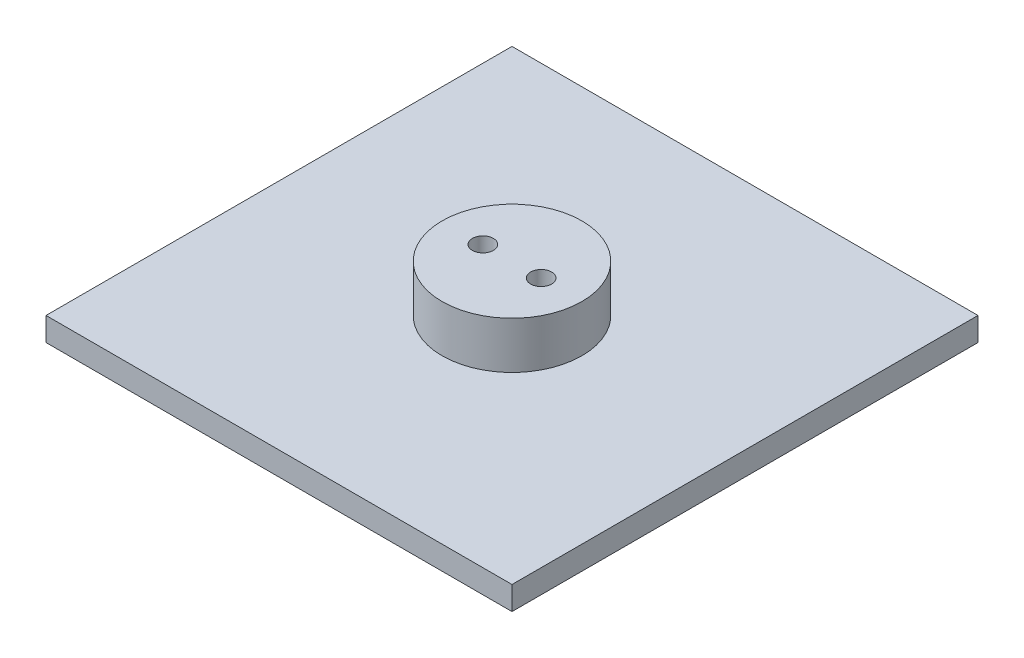
ISO-10303-21;
HEADER;
FILE_DESCRIPTION(('STEP AP214'),'2;1');
FILE_NAME('part.step','',(''),(''),'','','');
FILE_SCHEMA(('AUTOMOTIVE_DESIGN { 1 0 10303 214 1 1 1 1 }'));
ENDSEC;
DATA;
#1=APPLICATION_CONTEXT('core data for automotive mechanical design processes');
#2=APPLICATION_PROTOCOL_DEFINITION('international standard','automotive_design',2000,#1);
#3=PRODUCT_CONTEXT('',#1,'mechanical');
#4=PRODUCT('Part','Part','',(#3));
#5=PRODUCT_RELATED_PRODUCT_CATEGORY('part','',(#4));
#6=PRODUCT_DEFINITION_FORMATION('','',#4);
#7=PRODUCT_DEFINITION_CONTEXT('part definition',#1,'design');
#8=PRODUCT_DEFINITION('design','',#6,#7);
#9=PRODUCT_DEFINITION_SHAPE('','',#8);
#10=(LENGTH_UNIT() NAMED_UNIT(*) SI_UNIT(.MILLI.,.METRE.));
#11=(NAMED_UNIT(*) PLANE_ANGLE_UNIT() SI_UNIT($,.RADIAN.));
#12=(NAMED_UNIT(*) SI_UNIT($,.STERADIAN.) SOLID_ANGLE_UNIT());
#13=UNCERTAINTY_MEASURE_WITH_UNIT(LENGTH_MEASURE(1.E-05),#10,'distance_accuracy_value','');
#14=(GEOMETRIC_REPRESENTATION_CONTEXT(3) GLOBAL_UNCERTAINTY_ASSIGNED_CONTEXT((#13)) GLOBAL_UNIT_ASSIGNED_CONTEXT((#10,
#11,#12)) REPRESENTATION_CONTEXT('',''));
#15=CARTESIAN_POINT('',(0.,0.,0.));
#16=DIRECTION('',(0.,0.,1.));
#17=DIRECTION('',(1.,0.,0.));
#18=AXIS2_PLACEMENT_3D('',#15,#16,#17);
#19=CARTESIAN_POINT('',(0.,4.,0.));
#20=DIRECTION('',(1.,0.,0.));
#21=DIRECTION('',(0.,0.,-1.));
#22=AXIS2_PLACEMENT_3D('',#19,#20,#21);
#23=PLANE('',#22);
#24=DIRECTION('',(0.,0.,1.));
#25=VECTOR('',#24,1.);
#26=CARTESIAN_POINT('',(0.,0.,0.));
#27=LINE('',#26,#25);
#28=CARTESIAN_POINT('',(0.,0.,-79.375));
#29=VERTEX_POINT('',#28);
#30=CARTESIAN_POINT('',(0.,0.,0.));
#31=VERTEX_POINT('',#30);
#32=EDGE_CURVE('E99',#29,#31,#27,.T.);
#33=ORIENTED_EDGE('',*,*,#32,.T.);
#34=DIRECTION('',(0.,-1.,0.));
#35=VECTOR('',#34,1.);
#36=CARTESIAN_POINT('',(0.,4.,0.));
#37=LINE('',#36,#35);
#38=CARTESIAN_POINT('',(0.,4.,0.));
#39=VERTEX_POINT('',#38);
#40=EDGE_CURVE('E36',#39,#31,#37,.T.);
#41=ORIENTED_EDGE('',*,*,#40,.F.);
#42=DIRECTION('',(0.,0.,1.));
#43=VECTOR('',#42,1.);
#44=CARTESIAN_POINT('',(0.,4.,0.));
#45=LINE('',#44,#43);
#46=CARTESIAN_POINT('',(0.,4.,-79.375));
#47=VERTEX_POINT('',#46);
#48=EDGE_CURVE('E86',#47,#39,#45,.T.);
#49=ORIENTED_EDGE('',*,*,#48,.F.);
#50=DIRECTION('',(0.,-1.,0.));
#51=VECTOR('',#50,1.);
#52=CARTESIAN_POINT('',(0.,4.,-79.375));
#53=LINE('',#52,#51);
#54=EDGE_CURVE('E95',#47,#29,#53,.T.);
#55=ORIENTED_EDGE('',*,*,#54,.T.);
#56=EDGE_LOOP('',(#33,#41,#49,#55));
#57=FACE_BOUND('',#56,.T.);
#58=ADVANCED_FACE('F33',(#57),#23,.F.);
#59=CARTESIAN_POINT('',(0.,4.,0.));
#60=DIRECTION('',(0.,0.,-1.));
#61=DIRECTION('',(-1.,0.,0.));
#62=AXIS2_PLACEMENT_3D('',#59,#60,#61);
#63=PLANE('',#62);
#64=DIRECTION('',(1.,0.,0.));
#65=VECTOR('',#64,1.);
#66=CARTESIAN_POINT('',(0.,0.,0.));
#67=LINE('',#66,#65);
#68=CARTESIAN_POINT('',(79.375,0.,0.));
#69=VERTEX_POINT('',#68);
#70=EDGE_CURVE('E91',#31,#69,#67,.T.);
#71=ORIENTED_EDGE('',*,*,#70,.T.);
#72=DIRECTION('',(0.,-1.,0.));
#73=VECTOR('',#72,1.);
#74=CARTESIAN_POINT('',(79.375,4.,0.));
#75=LINE('',#74,#73);
#76=CARTESIAN_POINT('',(79.375,4.,0.));
#77=VERTEX_POINT('',#76);
#78=EDGE_CURVE('E89',#77,#69,#75,.T.);
#79=ORIENTED_EDGE('',*,*,#78,.F.);
#80=DIRECTION('',(1.,0.,0.));
#81=VECTOR('',#80,1.);
#82=CARTESIAN_POINT('',(0.,4.,0.));
#83=LINE('',#82,#81);
#84=EDGE_CURVE('E81',#39,#77,#83,.T.);
#85=ORIENTED_EDGE('',*,*,#84,.F.);
#86=ORIENTED_EDGE('',*,*,#40,.T.);
#87=EDGE_LOOP('',(#71,#79,#85,#86));
#88=FACE_BOUND('',#87,.T.);
#89=ADVANCED_FACE('F90',(#88),#63,.F.);
#90=CARTESIAN_POINT('',(79.375,4.,0.));
#91=DIRECTION('',(-1.,0.,0.));
#92=DIRECTION('',(0.,0.,1.));
#93=AXIS2_PLACEMENT_3D('',#90,#91,#92);
#94=PLANE('',#93);
#95=DIRECTION('',(0.,0.,-1.));
#96=VECTOR('',#95,1.);
#97=CARTESIAN_POINT('',(79.375,0.,0.));
#98=LINE('',#97,#96);
#99=CARTESIAN_POINT('',(79.375,0.,-79.375));
#100=VERTEX_POINT('',#99);
#101=EDGE_CURVE('E67',#69,#100,#98,.T.);
#102=ORIENTED_EDGE('',*,*,#101,.T.);
#103=DIRECTION('',(0.,-1.,0.));
#104=VECTOR('',#103,1.);
#105=CARTESIAN_POINT('',(79.375,4.,-79.375));
#106=LINE('',#105,#104);
#107=CARTESIAN_POINT('',(79.375,4.,-79.375));
#108=VERTEX_POINT('',#107);
#109=EDGE_CURVE('E92',#108,#100,#106,.T.);
#110=ORIENTED_EDGE('',*,*,#109,.F.);
#111=DIRECTION('',(0.,0.,-1.));
#112=VECTOR('',#111,1.);
#113=CARTESIAN_POINT('',(79.375,4.,0.));
#114=LINE('',#113,#112);
#115=EDGE_CURVE('E84',#77,#108,#114,.T.);
#116=ORIENTED_EDGE('',*,*,#115,.F.);
#117=ORIENTED_EDGE('',*,*,#78,.T.);
#118=EDGE_LOOP('',(#102,#110,#116,#117));
#119=FACE_BOUND('',#118,.T.);
#120=ADVANCED_FACE('F93',(#119),#94,.F.);
#121=CARTESIAN_POINT('',(0.,4.,-79.375));
#122=DIRECTION('',(0.,0.,1.));
#123=DIRECTION('',(1.,0.,0.));
#124=AXIS2_PLACEMENT_3D('',#121,#122,#123);
#125=PLANE('',#124);
#126=DIRECTION('',(-1.,0.,0.));
#127=VECTOR('',#126,1.);
#128=CARTESIAN_POINT('',(0.,0.,-79.375));
#129=LINE('',#128,#127);
#130=EDGE_CURVE('E73',#100,#29,#129,.T.);
#131=ORIENTED_EDGE('',*,*,#130,.T.);
#132=ORIENTED_EDGE('',*,*,#54,.F.);
#133=DIRECTION('',(-1.,0.,0.));
#134=VECTOR('',#133,1.);
#135=CARTESIAN_POINT('',(0.,4.,-79.375));
#136=LINE('',#135,#134);
#137=EDGE_CURVE('E50',#108,#47,#136,.T.);
#138=ORIENTED_EDGE('',*,*,#137,.F.);
#139=ORIENTED_EDGE('',*,*,#109,.T.);
#140=EDGE_LOOP('',(#131,#132,#138,#139));
#141=FACE_BOUND('',#140,.T.);
#142=ADVANCED_FACE('F107',(#141),#125,.F.);
#143=CARTESIAN_POINT('',(0.,4.,0.));
#144=DIRECTION('',(0.,-1.,0.));
#145=DIRECTION('',(0.,0.,-1.));
#146=AXIS2_PLACEMENT_3D('',#143,#144,#145);
#147=PLANE('',#146);
#148=CARTESIAN_POINT('',(39.6875,4.,-39.6875));
#149=DIRECTION('',(0.,1.,0.));
#150=DIRECTION('',(0.,0.,1.));
#151=AXIS2_PLACEMENT_3D('',#148,#149,#150);
#152=CIRCLE('',#151,11.90625);
#153=CARTESIAN_POINT('',(39.6875,4.,-27.78125));
#154=VERTEX_POINT('',#153);
#155=EDGE_CURVE('E11',#154,#154,#152,.T.);
#156=ORIENTED_EDGE('',*,*,#155,.F.);
#157=EDGE_LOOP('',(#156));
#158=FACE_BOUND('',#157,.T.);
#159=ORIENTED_EDGE('',*,*,#48,.T.);
#160=ORIENTED_EDGE('',*,*,#84,.T.);
#161=ORIENTED_EDGE('',*,*,#115,.T.);
#162=ORIENTED_EDGE('',*,*,#137,.T.);
#163=EDGE_LOOP('',(#159,#160,#161,#162));
#164=FACE_BOUND('',#163,.T.);
#165=ADVANCED_FACE('F82',(#158,#164),#147,.F.);
#166=CARTESIAN_POINT('',(0.,0.,0.));
#167=DIRECTION('',(0.,-1.,0.));
#168=DIRECTION('',(0.,0.,-1.));
#169=AXIS2_PLACEMENT_3D('',#166,#167,#168);
#170=PLANE('',#169);
#171=CARTESIAN_POINT('',(34.7265625,0.,-39.6875));
#172=DIRECTION('',(0.,-1.,0.));
#173=DIRECTION('',(0.,0.,-1.));
#174=AXIS2_PLACEMENT_3D('',#171,#172,#173);
#175=CIRCLE('',#174,1.7859375);
#176=CARTESIAN_POINT('',(34.7265625,0.,-41.4734375));
#177=VERTEX_POINT('',#176);
#178=EDGE_CURVE('E115',#177,#177,#175,.F.);
#179=ORIENTED_EDGE('',*,*,#178,.T.);
#180=EDGE_LOOP('',(#179));
#181=FACE_BOUND('',#180,.T.);
#182=CARTESIAN_POINT('',(44.6484375,0.,-39.6875));
#183=DIRECTION('',(0.,-1.,0.));
#184=DIRECTION('',(0.,0.,-1.));
#185=AXIS2_PLACEMENT_3D('',#182,#183,#184);
#186=CIRCLE('',#185,1.7859375);
#187=CARTESIAN_POINT('',(44.6484375,0.,-41.4734375));
#188=VERTEX_POINT('',#187);
#189=EDGE_CURVE('E116',#188,#188,#186,.F.);
#190=ORIENTED_EDGE('',*,*,#189,.T.);
#191=EDGE_LOOP('',(#190));
#192=FACE_BOUND('',#191,.T.);
#193=ORIENTED_EDGE('',*,*,#32,.F.);
#194=ORIENTED_EDGE('',*,*,#130,.F.);
#195=ORIENTED_EDGE('',*,*,#101,.F.);
#196=ORIENTED_EDGE('',*,*,#70,.F.);
#197=EDGE_LOOP('',(#193,#194,#195,#196));
#198=FACE_BOUND('',#197,.T.);
#199=ADVANCED_FACE('F110',(#181,#192,#198),#170,.T.);
#200=CARTESIAN_POINT('',(39.6875,12.,-39.6875));
#201=DIRECTION('',(0.,-1.,0.));
#202=DIRECTION('',(0.,0.,-1.));
#203=AXIS2_PLACEMENT_3D('',#200,#201,#202);
#204=CYLINDRICAL_SURFACE('',#203,11.90625);
#205=CARTESIAN_POINT('',(39.6875,12.,-39.6875));
#206=DIRECTION('',(0.,1.,0.));
#207=DIRECTION('',(0.,0.,1.));
#208=AXIS2_PLACEMENT_3D('',#205,#206,#207);
#209=CIRCLE('',#208,11.90625);
#210=CARTESIAN_POINT('',(39.6875,12.,-27.78125));
#211=VERTEX_POINT('',#210);
#212=EDGE_CURVE('E102',#211,#211,#209,.T.);
#213=ORIENTED_EDGE('',*,*,#212,.F.);
#214=EDGE_LOOP('',(#213));
#215=FACE_BOUND('',#214,.T.);
#216=ORIENTED_EDGE('',*,*,#155,.T.);
#217=EDGE_LOOP('',(#216));
#218=FACE_BOUND('',#217,.T.);
#219=ADVANCED_FACE('F135',(#215,#218),#204,.T.);
#220=CARTESIAN_POINT('',(39.6875,12.,-39.6875));
#221=DIRECTION('',(0.,1.,0.));
#222=DIRECTION('',(0.,0.,1.));
#223=AXIS2_PLACEMENT_3D('',#220,#221,#222);
#224=PLANE('',#223);
#225=CARTESIAN_POINT('',(34.7265625,12.,-39.6875));
#226=DIRECTION('',(0.,1.,0.));
#227=DIRECTION('',(0.,0.,1.));
#228=AXIS2_PLACEMENT_3D('',#225,#226,#227);
#229=CIRCLE('',#228,1.7859375);
#230=CARTESIAN_POINT('',(34.7265625,12.,-37.9015625));
#231=VERTEX_POINT('',#230);
#232=EDGE_CURVE('E119',#231,#231,#229,.T.);
#233=ORIENTED_EDGE('',*,*,#232,.F.);
#234=EDGE_LOOP('',(#233));
#235=FACE_BOUND('',#234,.T.);
#236=CARTESIAN_POINT('',(44.6484375,12.,-39.6875));
#237=DIRECTION('',(0.,1.,0.));
#238=DIRECTION('',(0.,0.,1.));
#239=AXIS2_PLACEMENT_3D('',#236,#237,#238);
#240=CIRCLE('',#239,1.7859375);
#241=CARTESIAN_POINT('',(44.6484375,12.,-37.9015625));
#242=VERTEX_POINT('',#241);
#243=EDGE_CURVE('E120',#242,#242,#240,.T.);
#244=ORIENTED_EDGE('',*,*,#243,.F.);
#245=EDGE_LOOP('',(#244));
#246=FACE_BOUND('',#245,.T.);
#247=ORIENTED_EDGE('',*,*,#212,.T.);
#248=EDGE_LOOP('',(#247));
#249=FACE_BOUND('',#248,.T.);
#250=ADVANCED_FACE('F131',(#235,#246,#249),#224,.T.);
#251=CARTESIAN_POINT('',(44.6484375,-5.0513940681014,-39.6875));
#252=DIRECTION('',(0.,1.,0.));
#253=DIRECTION('',(0.,0.,1.));
#254=AXIS2_PLACEMENT_3D('',#251,#252,#253);
#255=CYLINDRICAL_SURFACE('',#254,1.7859375);
#256=ORIENTED_EDGE('',*,*,#243,.T.);
#257=EDGE_LOOP('',(#256));
#258=FACE_BOUND('',#257,.T.);
#259=ORIENTED_EDGE('',*,*,#189,.F.);
#260=EDGE_LOOP('',(#259));
#261=FACE_BOUND('',#260,.T.);
#262=ADVANCED_FACE('F134',(#258,#261),#255,.F.);
#263=CARTESIAN_POINT('',(34.7265625,-5.0513940681014,-39.6875));
#264=DIRECTION('',(0.,1.,0.));
#265=DIRECTION('',(0.,0.,1.));
#266=AXIS2_PLACEMENT_3D('',#263,#264,#265);
#267=CYLINDRICAL_SURFACE('',#266,1.7859375);
#268=ORIENTED_EDGE('',*,*,#232,.T.);
#269=EDGE_LOOP('',(#268));
#270=FACE_BOUND('',#269,.T.);
#271=ORIENTED_EDGE('',*,*,#178,.F.);
#272=EDGE_LOOP('',(#271));
#273=FACE_BOUND('',#272,.T.);
#274=ADVANCED_FACE('F128',(#270,#273),#267,.F.);
#275=CLOSED_SHELL('',(#58,#89,#120,#142,#165,#199,#219,#250,#262,#274));
#276=MANIFOLD_SOLID_BREP('B2',#275);
#277=ADVANCED_BREP_SHAPE_REPRESENTATION('',(#18,#276),#14);
#278=SHAPE_DEFINITION_REPRESENTATION(#9,#277);
ENDSEC;
END-ISO-10303-21;
